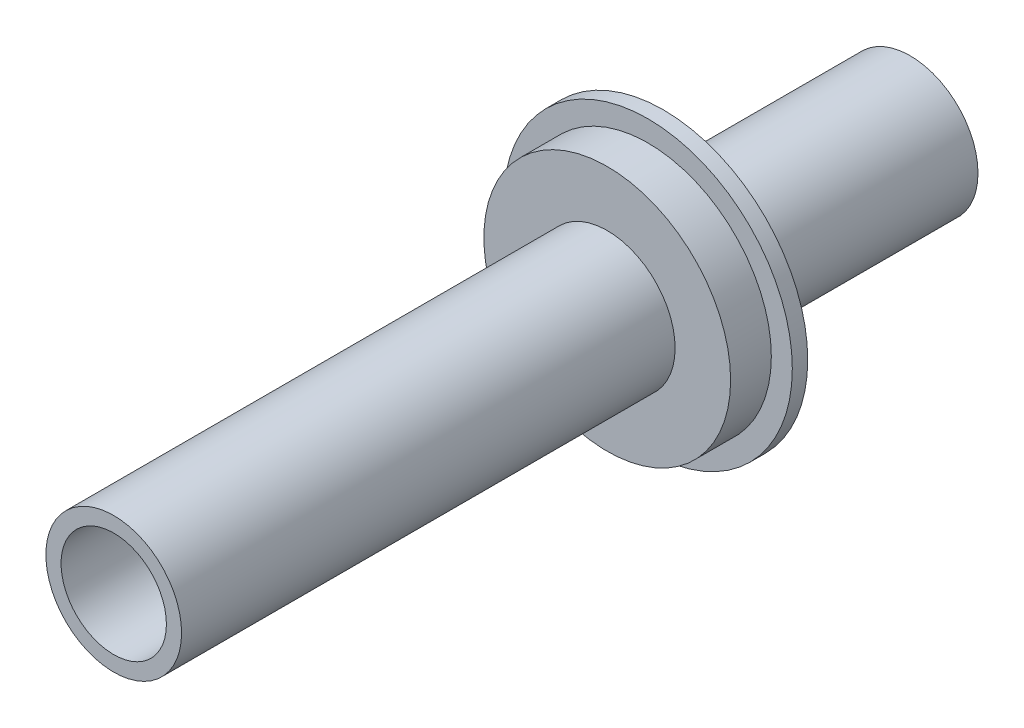
ISO-10303-21;
HEADER;
FILE_DESCRIPTION(('STEP AP214'),'2;1');
FILE_NAME('part.step','',(''),(''),'','','');
FILE_SCHEMA(('AUTOMOTIVE_DESIGN { 1 0 10303 214 1 1 1 1 }'));
ENDSEC;
DATA;
#1=APPLICATION_CONTEXT('core data for automotive mechanical design processes');
#2=APPLICATION_PROTOCOL_DEFINITION('international standard','automotive_design',2000,#1);
#3=PRODUCT_CONTEXT('',#1,'mechanical');
#4=PRODUCT('Part','Part','',(#3));
#5=PRODUCT_RELATED_PRODUCT_CATEGORY('part','',(#4));
#6=PRODUCT_DEFINITION_FORMATION('','',#4);
#7=PRODUCT_DEFINITION_CONTEXT('part definition',#1,'design');
#8=PRODUCT_DEFINITION('design','',#6,#7);
#9=PRODUCT_DEFINITION_SHAPE('','',#8);
#10=(LENGTH_UNIT() NAMED_UNIT(*) SI_UNIT(.MILLI.,.METRE.));
#11=(NAMED_UNIT(*) PLANE_ANGLE_UNIT() SI_UNIT($,.RADIAN.));
#12=(NAMED_UNIT(*) SI_UNIT($,.STERADIAN.) SOLID_ANGLE_UNIT());
#13=UNCERTAINTY_MEASURE_WITH_UNIT(LENGTH_MEASURE(1.E-05),#10,'distance_accuracy_value','');
#14=(GEOMETRIC_REPRESENTATION_CONTEXT(3) GLOBAL_UNCERTAINTY_ASSIGNED_CONTEXT((#13)) GLOBAL_UNIT_ASSIGNED_CONTEXT((#10,
#11,#12)) REPRESENTATION_CONTEXT('',''));
#15=CARTESIAN_POINT('',(0.,0.,0.));
#16=DIRECTION('',(0.,0.,1.));
#17=DIRECTION('',(1.,0.,0.));
#18=AXIS2_PLACEMENT_3D('',#15,#16,#17);
#19=CARTESIAN_POINT('',(0.,0.,50.8));
#20=DIRECTION('',(0.,0.,-1.));
#21=DIRECTION('',(-1.,0.,0.));
#22=AXIS2_PLACEMENT_3D('',#19,#20,#21);
#23=CYLINDRICAL_SURFACE('',#22,13.97);
#24=CARTESIAN_POINT('',(0.,0.,50.8));
#25=DIRECTION('',(0.,0.,1.));
#26=DIRECTION('',(1.,0.,0.));
#27=AXIS2_PLACEMENT_3D('',#24,#25,#26);
#28=CIRCLE('',#27,13.97);
#29=CARTESIAN_POINT('',(13.97,0.,50.8));
#30=VERTEX_POINT('',#29);
#31=EDGE_CURVE('E43',#30,#30,#28,.T.);
#32=ORIENTED_EDGE('',*,*,#31,.F.);
#33=EDGE_LOOP('',(#32));
#34=FACE_BOUND('',#33,.T.);
#35=CARTESIAN_POINT('',(0.,0.,0.));
#36=DIRECTION('',(0.,0.,1.));
#37=DIRECTION('',(1.,0.,0.));
#38=AXIS2_PLACEMENT_3D('',#35,#36,#37);
#39=CIRCLE('',#38,13.97);
#40=CARTESIAN_POINT('',(13.97,0.,0.));
#41=VERTEX_POINT('',#40);
#42=EDGE_CURVE('E34',#41,#41,#39,.T.);
#43=ORIENTED_EDGE('',*,*,#42,.T.);
#44=EDGE_LOOP('',(#43));
#45=FACE_BOUND('',#44,.T.);
#46=ADVANCED_FACE('F31',(#34,#45),#23,.T.);
#47=CARTESIAN_POINT('',(0.,0.,0.));
#48=DIRECTION('',(0.,0.,1.));
#49=DIRECTION('',(1.,0.,0.));
#50=AXIS2_PLACEMENT_3D('',#47,#48,#49);
#51=PLANE('',#50);
#52=ORIENTED_EDGE('',*,*,#42,.F.);
#53=EDGE_LOOP('',(#52));
#54=FACE_BOUND('',#53,.T.);
#55=ADVANCED_FACE('F64',(#54),#51,.F.);
#56=CARTESIAN_POINT('',(0.,0.,53.975));
#57=DIRECTION('',(0.,0.,-1.));
#58=DIRECTION('',(-1.,0.,0.));
#59=AXIS2_PLACEMENT_3D('',#56,#57,#58);
#60=CYLINDRICAL_SURFACE('',#59,29.718);
#61=CARTESIAN_POINT('',(0.,0.,53.975));
#62=DIRECTION('',(0.,0.,1.));
#63=DIRECTION('',(1.,0.,0.));
#64=AXIS2_PLACEMENT_3D('',#61,#62,#63);
#65=CIRCLE('',#64,29.718);
#66=CARTESIAN_POINT('',(29.718,0.,53.975));
#67=VERTEX_POINT('',#66);
#68=EDGE_CURVE('E53',#67,#67,#65,.T.);
#69=ORIENTED_EDGE('',*,*,#68,.F.);
#70=EDGE_LOOP('',(#69));
#71=FACE_BOUND('',#70,.T.);
#72=CARTESIAN_POINT('',(0.,0.,50.8));
#73=DIRECTION('',(0.,0.,1.));
#74=DIRECTION('',(1.,0.,0.));
#75=AXIS2_PLACEMENT_3D('',#72,#73,#74);
#76=CIRCLE('',#75,29.718);
#77=CARTESIAN_POINT('',(29.718,0.,50.8));
#78=VERTEX_POINT('',#77);
#79=EDGE_CURVE('E51',#78,#78,#76,.T.);
#80=ORIENTED_EDGE('',*,*,#79,.T.);
#81=EDGE_LOOP('',(#80));
#82=FACE_BOUND('',#81,.T.);
#83=ADVANCED_FACE('F66',(#71,#82),#60,.T.);
#84=CARTESIAN_POINT('',(0.,0.,53.975));
#85=DIRECTION('',(0.,0.,1.));
#86=DIRECTION('',(1.,0.,0.));
#87=AXIS2_PLACEMENT_3D('',#84,#85,#86);
#88=PLANE('',#87);
#89=CARTESIAN_POINT('',(0.,0.,53.975));
#90=DIRECTION('',(0.,0.,1.));
#91=DIRECTION('',(1.,0.,0.));
#92=AXIS2_PLACEMENT_3D('',#89,#90,#91);
#93=CIRCLE('',#92,25.4);
#94=CARTESIAN_POINT('',(25.4,0.,53.975));
#95=VERTEX_POINT('',#94);
#96=EDGE_CURVE('E38',#95,#95,#93,.T.);
#97=ORIENTED_EDGE('',*,*,#96,.F.);
#98=EDGE_LOOP('',(#97));
#99=FACE_BOUND('',#98,.T.);
#100=ORIENTED_EDGE('',*,*,#68,.T.);
#101=EDGE_LOOP('',(#100));
#102=FACE_BOUND('',#101,.T.);
#103=ADVANCED_FACE('F71',(#99,#102),#88,.T.);
#104=CARTESIAN_POINT('',(0.,0.,50.8));
#105=DIRECTION('',(0.,0.,1.));
#106=DIRECTION('',(1.,0.,0.));
#107=AXIS2_PLACEMENT_3D('',#104,#105,#106);
#108=PLANE('',#107);
#109=ORIENTED_EDGE('',*,*,#31,.T.);
#110=EDGE_LOOP('',(#109));
#111=FACE_BOUND('',#110,.T.);
#112=ORIENTED_EDGE('',*,*,#79,.F.);
#113=EDGE_LOOP('',(#112));
#114=FACE_BOUND('',#113,.T.);
#115=ADVANCED_FACE('F76',(#111,#114),#108,.F.);
#116=CARTESIAN_POINT('',(0.,0.,62.357));
#117=DIRECTION('',(0.,0.,-1.));
#118=DIRECTION('',(-1.,0.,0.));
#119=AXIS2_PLACEMENT_3D('',#116,#117,#118);
#120=CYLINDRICAL_SURFACE('',#119,25.4);
#121=CARTESIAN_POINT('',(0.,0.,62.357));
#122=DIRECTION('',(0.,0.,1.));
#123=DIRECTION('',(1.,0.,0.));
#124=AXIS2_PLACEMENT_3D('',#121,#122,#123);
#125=CIRCLE('',#124,25.4);
#126=CARTESIAN_POINT('',(25.4,0.,62.357));
#127=VERTEX_POINT('',#126);
#128=EDGE_CURVE('E49',#127,#127,#125,.T.);
#129=ORIENTED_EDGE('',*,*,#128,.F.);
#130=EDGE_LOOP('',(#129));
#131=FACE_BOUND('',#130,.T.);
#132=ORIENTED_EDGE('',*,*,#96,.T.);
#133=EDGE_LOOP('',(#132));
#134=FACE_BOUND('',#133,.T.);
#135=ADVANCED_FACE('F79',(#131,#134),#120,.T.);
#136=CARTESIAN_POINT('',(0.,0.,62.357));
#137=DIRECTION('',(0.,0.,1.));
#138=DIRECTION('',(1.,0.,0.));
#139=AXIS2_PLACEMENT_3D('',#136,#137,#138);
#140=PLANE('',#139);
#141=CARTESIAN_POINT('',(0.,0.,62.357));
#142=DIRECTION('',(0.,0.,1.));
#143=DIRECTION('',(1.,0.,0.));
#144=AXIS2_PLACEMENT_3D('',#141,#142,#143);
#145=CIRCLE('',#144,13.97);
#146=CARTESIAN_POINT('',(13.97,0.,62.357));
#147=VERTEX_POINT('',#146);
#148=EDGE_CURVE('E10',#147,#147,#145,.T.);
#149=ORIENTED_EDGE('',*,*,#148,.F.);
#150=EDGE_LOOP('',(#149));
#151=FACE_BOUND('',#150,.T.);
#152=ORIENTED_EDGE('',*,*,#128,.T.);
#153=EDGE_LOOP('',(#152));
#154=FACE_BOUND('',#153,.T.);
#155=ADVANCED_FACE('F85',(#151,#154),#140,.T.);
#156=CARTESIAN_POINT('',(0.,0.,163.957));
#157=DIRECTION('',(0.,0.,-1.));
#158=DIRECTION('',(-1.,0.,0.));
#159=AXIS2_PLACEMENT_3D('',#156,#157,#158);
#160=CYLINDRICAL_SURFACE('',#159,13.97);
#161=CARTESIAN_POINT('',(0.,0.,163.957));
#162=DIRECTION('',(0.,0.,1.));
#163=DIRECTION('',(1.,0.,0.));
#164=AXIS2_PLACEMENT_3D('',#161,#162,#163);
#165=CIRCLE('',#164,13.97);
#166=CARTESIAN_POINT('',(13.97,0.,163.957));
#167=VERTEX_POINT('',#166);
#168=EDGE_CURVE('E47',#167,#167,#165,.T.);
#169=ORIENTED_EDGE('',*,*,#168,.F.);
#170=EDGE_LOOP('',(#169));
#171=FACE_BOUND('',#170,.T.);
#172=ORIENTED_EDGE('',*,*,#148,.T.);
#173=EDGE_LOOP('',(#172));
#174=FACE_BOUND('',#173,.T.);
#175=ADVANCED_FACE('F89',(#171,#174),#160,.T.);
#176=CARTESIAN_POINT('',(0.,0.,163.957));
#177=DIRECTION('',(0.,0.,1.));
#178=DIRECTION('',(1.,0.,0.));
#179=AXIS2_PLACEMENT_3D('',#176,#177,#178);
#180=PLANE('',#179);
#181=CARTESIAN_POINT('',(0.,0.,163.957));
#182=DIRECTION('',(0.,0.,1.));
#183=DIRECTION('',(1.,0.,0.));
#184=AXIS2_PLACEMENT_3D('',#181,#182,#183);
#185=CIRCLE('',#184,10.8428241116246);
#186=CARTESIAN_POINT('',(10.8428241116246,0.,163.957));
#187=VERTEX_POINT('',#186);
#188=EDGE_CURVE('E110',#187,#187,#185,.T.);
#189=ORIENTED_EDGE('',*,*,#188,.F.);
#190=EDGE_LOOP('',(#189));
#191=FACE_BOUND('',#190,.T.);
#192=ORIENTED_EDGE('',*,*,#168,.T.);
#193=EDGE_LOOP('',(#192));
#194=FACE_BOUND('',#193,.T.);
#195=ADVANCED_FACE('F93',(#191,#194),#180,.T.);
#196=CARTESIAN_POINT('',(0.,0.,31.6888621738291));
#197=DIRECTION('',(0.,0.,1.));
#198=DIRECTION('',(1.,0.,0.));
#199=AXIS2_PLACEMENT_3D('',#196,#197,#198);
#200=CYLINDRICAL_SURFACE('',#199,10.8428241116246);
#201=CARTESIAN_POINT('',(0.,0.,62.357));
#202=DIRECTION('',(0.,0.,1.));
#203=DIRECTION('',(1.,0.,0.));
#204=AXIS2_PLACEMENT_3D('',#201,#202,#203);
#205=CIRCLE('',#204,10.8428241116246);
#206=CARTESIAN_POINT('',(10.8428241116246,0.,62.357));
#207=VERTEX_POINT('',#206);
#208=EDGE_CURVE('E109',#207,#207,#205,.F.);
#209=ORIENTED_EDGE('',*,*,#208,.T.);
#210=EDGE_LOOP('',(#209));
#211=FACE_BOUND('',#210,.T.);
#212=ORIENTED_EDGE('',*,*,#188,.T.);
#213=EDGE_LOOP('',(#212));
#214=FACE_BOUND('',#213,.T.);
#215=ADVANCED_FACE('F97',(#211,#214),#200,.F.);
#216=CARTESIAN_POINT('',(0.,0.,62.357));
#217=DIRECTION('',(0.,0.,1.));
#218=DIRECTION('',(1.,0.,0.));
#219=AXIS2_PLACEMENT_3D('',#216,#217,#218);
#220=PLANE('',#219);
#221=ORIENTED_EDGE('',*,*,#208,.F.);
#222=EDGE_LOOP('',(#221));
#223=FACE_BOUND('',#222,.T.);
#224=ADVANCED_FACE('F101',(#223),#220,.T.);
#225=CLOSED_SHELL('',(#46,#55,#83,#103,#115,#135,#155,#175,#195,#215,#224));
#226=MANIFOLD_SOLID_BREP('B2',#225);
#227=ADVANCED_BREP_SHAPE_REPRESENTATION('',(#18,#226),#14);
#228=SHAPE_DEFINITION_REPRESENTATION(#9,#227);
ENDSEC;
END-ISO-10303-21;
